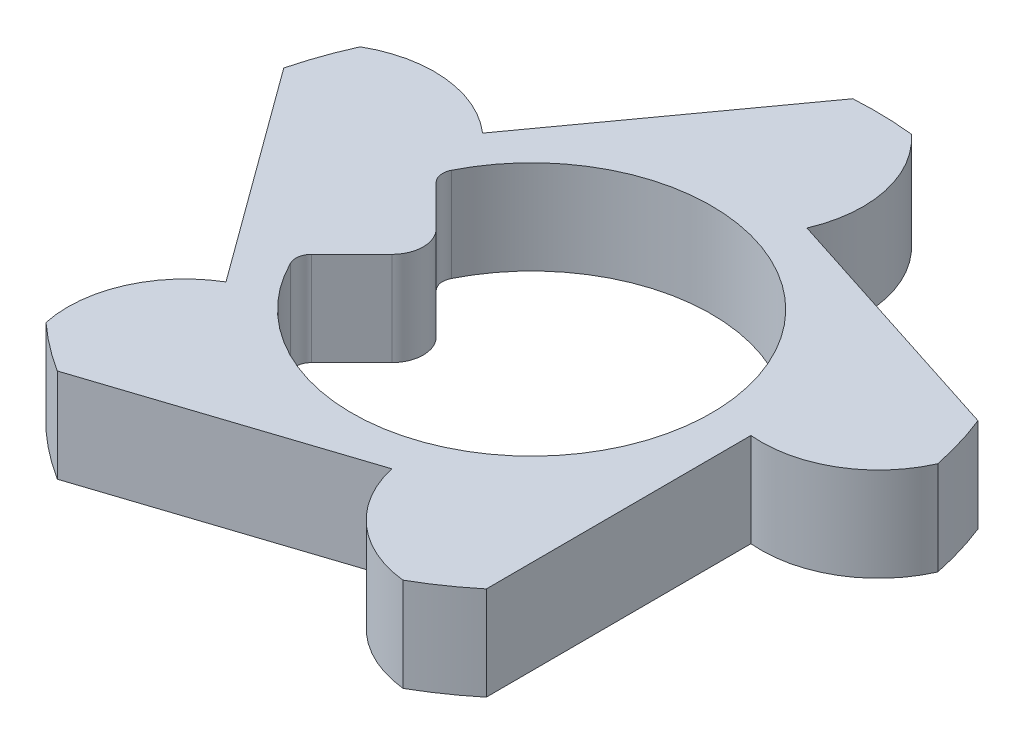
ISO-10303-21;
HEADER;
FILE_DESCRIPTION(('STEP AP214'),'2;1');
FILE_NAME('part.step','',(''),(''),'','','');
FILE_SCHEMA(('AUTOMOTIVE_DESIGN { 1 0 10303 214 1 1 1 1 }'));
ENDSEC;
DATA;
#1=APPLICATION_CONTEXT('core data for automotive mechanical design processes');
#2=APPLICATION_PROTOCOL_DEFINITION('international standard','automotive_design',2000,#1);
#3=PRODUCT_CONTEXT('',#1,'mechanical');
#4=PRODUCT('Part','Part','',(#3));
#5=PRODUCT_RELATED_PRODUCT_CATEGORY('part','',(#4));
#6=PRODUCT_DEFINITION_FORMATION('','',#4);
#7=PRODUCT_DEFINITION_CONTEXT('part definition',#1,'design');
#8=PRODUCT_DEFINITION('design','',#6,#7);
#9=PRODUCT_DEFINITION_SHAPE('','',#8);
#10=(LENGTH_UNIT() NAMED_UNIT(*) SI_UNIT(.MILLI.,.METRE.));
#11=(NAMED_UNIT(*) PLANE_ANGLE_UNIT() SI_UNIT($,.RADIAN.));
#12=(NAMED_UNIT(*) SI_UNIT($,.STERADIAN.) SOLID_ANGLE_UNIT());
#13=UNCERTAINTY_MEASURE_WITH_UNIT(LENGTH_MEASURE(1.E-05),#10,'distance_accuracy_value','');
#14=(GEOMETRIC_REPRESENTATION_CONTEXT(3) GLOBAL_UNCERTAINTY_ASSIGNED_CONTEXT((#13)) GLOBAL_UNIT_ASSIGNED_CONTEXT((#10,
#11,#12)) REPRESENTATION_CONTEXT('',''));
#15=CARTESIAN_POINT('',(0.,0.,0.));
#16=DIRECTION('',(0.,0.,1.));
#17=DIRECTION('',(1.,0.,0.));
#18=AXIS2_PLACEMENT_3D('',#15,#16,#17);
#19=CARTESIAN_POINT('',(0.,0.6,0.));
#20=DIRECTION('',(0.,-1.,0.));
#21=DIRECTION('',(0.,0.,-1.));
#22=AXIS2_PLACEMENT_3D('',#19,#20,#21);
#23=CYLINDRICAL_SURFACE('',#22,2.2);
#24=CARTESIAN_POINT('',(0.,0.,0.));
#25=DIRECTION('',(0.,1.,0.));
#26=DIRECTION('',(0.,0.,1.));
#27=AXIS2_PLACEMENT_3D('',#24,#25,#26);
#28=CIRCLE('',#27,2.2);
#29=CARTESIAN_POINT('',(0.243112339246083,0.,-2.18652610103477));
#30=VERTEX_POINT('',#29);
#31=CARTESIAN_POINT('',(-0.140209263389329,0.,-2.19552758180348));
#32=VERTEX_POINT('',#31);
#33=EDGE_CURVE('E212',#30,#32,#28,.T.);
#34=ORIENTED_EDGE('',*,*,#33,.T.);
#35=DIRECTION('',(0.,-1.,0.));
#36=VECTOR('',#35,1.);
#37=CARTESIAN_POINT('',(-0.140209263389329,0.6,-2.19552758180348));
#38=LINE('',#37,#36);
#39=CARTESIAN_POINT('',(-0.140209263389329,0.6,-2.19552758180348));
#40=VERTEX_POINT('',#39);
#41=EDGE_CURVE('E193',#40,#32,#38,.T.);
#42=ORIENTED_EDGE('',*,*,#41,.F.);
#43=CARTESIAN_POINT('',(0.,0.6,0.));
#44=DIRECTION('',(0.,1.,0.));
#45=DIRECTION('',(0.,0.,1.));
#46=AXIS2_PLACEMENT_3D('',#43,#44,#45);
#47=CIRCLE('',#46,2.2);
#48=CARTESIAN_POINT('',(0.243112339246083,0.6,-2.18652610103477));
#49=VERTEX_POINT('',#48);
#50=EDGE_CURVE('E200',#49,#40,#47,.T.);
#51=ORIENTED_EDGE('',*,*,#50,.F.);
#52=DIRECTION('',(0.,-1.,0.));
#53=VECTOR('',#52,1.);
#54=CARTESIAN_POINT('',(0.243112339246083,0.6,-2.18652610103477));
#55=LINE('',#54,#53);
#56=EDGE_CURVE('E284',#49,#30,#55,.T.);
#57=ORIENTED_EDGE('',*,*,#56,.T.);
#58=EDGE_LOOP('',(#34,#42,#51,#57));
#59=FACE_BOUND('',#58,.T.);
#60=ADVANCED_FACE('F47',(#59),#23,.T.);
#61=CARTESIAN_POINT('',(-1.13452842133559,0.6,-0.820271455788742));
#62=DIRECTION('',(0.810377443811132,0.,0.585908182706246));
#63=DIRECTION('',(0.585908182706246,0.,-0.810377443811132));
#64=AXIS2_PLACEMENT_3D('',#61,#62,#63);
#65=PLANE('',#64);
#66=DIRECTION('',(-0.585908182706246,0.,0.810377443811132));
#67=VECTOR('',#66,1.);
#68=CARTESIAN_POINT('',(-1.13452842133559,0.,-0.820271455788742));
#69=LINE('',#68,#67);
#70=CARTESIAN_POINT('',(-1.13452842133559,0.,-0.820271455788742));
#71=VERTEX_POINT('',#70);
#72=EDGE_CURVE('E286',#32,#71,#69,.T.);
#73=ORIENTED_EDGE('',*,*,#72,.T.);
#74=DIRECTION('',(0.,-1.,0.));
#75=VECTOR('',#74,1.);
#76=CARTESIAN_POINT('',(-1.13452842133559,0.6,-0.820271455788742));
#77=LINE('',#76,#75);
#78=CARTESIAN_POINT('',(-1.13452842133559,0.6,-0.820271455788742));
#79=VERTEX_POINT('',#78);
#80=EDGE_CURVE('E196',#79,#71,#77,.T.);
#81=ORIENTED_EDGE('',*,*,#80,.F.);
#82=DIRECTION('',(-0.585908182706246,0.,0.810377443811132));
#83=VECTOR('',#82,1.);
#84=CARTESIAN_POINT('',(-1.13452842133559,0.6,-0.820271455788742));
#85=LINE('',#84,#83);
#86=EDGE_CURVE('E189',#40,#79,#85,.T.);
#87=ORIENTED_EDGE('',*,*,#86,.F.);
#88=ORIENTED_EDGE('',*,*,#41,.T.);
#89=EDGE_LOOP('',(#73,#81,#87,#88));
#90=FACE_BOUND('',#89,.T.);
#91=ADVANCED_FACE('F191',(#90),#65,.F.);
#92=CARTESIAN_POINT('',(-1.62984623689458,0.6,-0.25710162208858));
#93=DIRECTION('',(0.,-1.,0.));
#94=DIRECTION('',(0.,0.,-1.));
#95=AXIS2_PLACEMENT_3D('',#92,#93,#94);
#96=CYLINDRICAL_SURFACE('',#95,0.75);
#97=CARTESIAN_POINT('',(-1.62984623689458,0.,-0.25710162208858));
#98=DIRECTION('',(0.,1.,0.));
#99=DIRECTION('',(0.,0.,1.));
#100=AXIS2_PLACEMENT_3D('',#97,#98,#99);
#101=CIRCLE('',#100,0.75);
#102=CARTESIAN_POINT('',(-2.00438405206926,0.,-0.906887298295876));
#103=VERTEX_POINT('',#102);
#104=EDGE_CURVE('E288',#71,#103,#101,.T.);
#105=ORIENTED_EDGE('',*,*,#104,.T.);
#106=DIRECTION('',(0.,-1.,0.));
#107=VECTOR('',#106,1.);
#108=CARTESIAN_POINT('',(-2.00438405206926,0.6,-0.906887298295876));
#109=LINE('',#108,#107);
#110=CARTESIAN_POINT('',(-2.00438405206926,0.6,-0.906887298295876));
#111=VERTEX_POINT('',#110);
#112=EDGE_CURVE('E218',#111,#103,#109,.T.);
#113=ORIENTED_EDGE('',*,*,#112,.F.);
#114=CARTESIAN_POINT('',(-1.62984623689458,0.6,-0.25710162208858));
#115=DIRECTION('',(0.,1.,0.));
#116=DIRECTION('',(0.,0.,1.));
#117=AXIS2_PLACEMENT_3D('',#114,#115,#116);
#118=CIRCLE('',#117,0.75);
#119=EDGE_CURVE('E199',#79,#111,#118,.T.);
#120=ORIENTED_EDGE('',*,*,#119,.F.);
#121=ORIENTED_EDGE('',*,*,#80,.T.);
#122=EDGE_LOOP('',(#105,#113,#120,#121));
#123=FACE_BOUND('',#122,.T.);
#124=ADVANCED_FACE('F370',(#123),#96,.T.);
#125=CARTESIAN_POINT('',(0.,0.6,0.));
#126=DIRECTION('',(0.,-1.,0.));
#127=DIRECTION('',(0.,0.,-1.));
#128=AXIS2_PLACEMENT_3D('',#125,#126,#127);
#129=CYLINDRICAL_SURFACE('',#128,2.2);
#130=CARTESIAN_POINT('',(0.,0.,0.));
#131=DIRECTION('',(0.,1.,0.));
#132=DIRECTION('',(0.,0.,1.));
#133=AXIS2_PLACEMENT_3D('',#130,#131,#132);
#134=CIRCLE('',#133,2.2);
#135=CARTESIAN_POINT('',(-2.13139785853603,0.,-0.545108400804861));
#136=VERTEX_POINT('',#135);
#137=EDGE_CURVE('E290',#103,#136,#134,.T.);
#138=ORIENTED_EDGE('',*,*,#137,.T.);
#139=DIRECTION('',(0.,-1.,0.));
#140=VECTOR('',#139,1.);
#141=CARTESIAN_POINT('',(-2.13139785853603,0.6,-0.545108400804861));
#142=LINE('',#141,#140);
#143=CARTESIAN_POINT('',(-2.13139785853603,0.6,-0.545108400804861));
#144=VERTEX_POINT('',#143);
#145=EDGE_CURVE('E344',#144,#136,#142,.T.);
#146=ORIENTED_EDGE('',*,*,#145,.F.);
#147=CARTESIAN_POINT('',(0.,0.6,0.));
#148=DIRECTION('',(0.,1.,0.));
#149=DIRECTION('',(0.,0.,1.));
#150=AXIS2_PLACEMENT_3D('',#147,#148,#149);
#151=CIRCLE('',#150,2.2);
#152=EDGE_CURVE('E261',#111,#144,#151,.T.);
#153=ORIENTED_EDGE('',*,*,#152,.F.);
#154=ORIENTED_EDGE('',*,*,#112,.T.);
#155=EDGE_LOOP('',(#138,#146,#153,#154));
#156=FACE_BOUND('',#155,.T.);
#157=ADVANCED_FACE('F351',(#156),#129,.T.);
#158=CARTESIAN_POINT('',(-1.13071307595288,0.6,0.825522828193851));
#159=DIRECTION('',(0.807652197109201,0.,-0.589659162995608));
#160=DIRECTION('',(-0.589659162995608,0.,-0.807652197109201));
#161=AXIS2_PLACEMENT_3D('',#158,#159,#160);
#162=PLANE('',#161);
#163=DIRECTION('',(0.589659162995608,0.,0.8076521971092));
#164=VECTOR('',#163,1.);
#165=CARTESIAN_POINT('',(-1.13071307595288,0.,0.825522828193851));
#166=LINE('',#165,#164);
#167=CARTESIAN_POINT('',(-1.13071307595288,0.,0.825522828193851));
#168=VERTEX_POINT('',#167);
#169=EDGE_CURVE('E292',#136,#168,#166,.T.);
#170=ORIENTED_EDGE('',*,*,#169,.T.);
#171=DIRECTION('',(0.,-1.,0.));
#172=VECTOR('',#171,1.);
#173=CARTESIAN_POINT('',(-1.13071307595288,0.6,0.825522828193851));
#174=LINE('',#173,#172);
#175=CARTESIAN_POINT('',(-1.13071307595288,0.6,0.825522828193851));
#176=VERTEX_POINT('',#175);
#177=EDGE_CURVE('E341',#176,#168,#174,.T.);
#178=ORIENTED_EDGE('',*,*,#177,.F.);
#179=DIRECTION('',(0.589659162995608,0.,0.8076521971092));
#180=VECTOR('',#179,1.);
#181=CARTESIAN_POINT('',(-1.13071307595288,0.6,0.825522828193851));
#182=LINE('',#181,#180);
#183=EDGE_CURVE('E263',#144,#176,#182,.T.);
#184=ORIENTED_EDGE('',*,*,#183,.F.);
#185=ORIENTED_EDGE('',*,*,#145,.T.);
#186=EDGE_LOOP('',(#170,#178,#184,#185));
#187=FACE_BOUND('',#186,.T.);
#188=ADVANCED_FACE('F362',(#187),#162,.F.);
#189=CARTESIAN_POINT('',(-0.748168358455879,0.6,1.47062711365099));
#190=DIRECTION('',(0.,-1.,0.));
#191=DIRECTION('',(0.,0.,-1.));
#192=AXIS2_PLACEMENT_3D('',#189,#190,#191);
#193=CYLINDRICAL_SURFACE('',#192,0.750000000000016);
#194=CARTESIAN_POINT('',(-0.748168358455879,0.,1.47062711365099));
#195=DIRECTION('',(0.,1.,0.));
#196=DIRECTION('',(0.,0.,1.));
#197=AXIS2_PLACEMENT_3D('',#194,#195,#196);
#198=CIRCLE('',#197,0.750000000000016);
#199=CARTESIAN_POINT('',(-1.48188980993314,0.,1.62603892672233));
#200=VERTEX_POINT('',#199);
#201=EDGE_CURVE('E294',#168,#200,#198,.T.);
#202=ORIENTED_EDGE('',*,*,#201,.T.);
#203=DIRECTION('',(0.,-1.,0.));
#204=VECTOR('',#203,1.);
#205=CARTESIAN_POINT('',(-1.48188980993314,0.6,1.62603892672233));
#206=LINE('',#205,#204);
#207=CARTESIAN_POINT('',(-1.48188980993314,0.6,1.62603892672233));
#208=VERTEX_POINT('',#207);
#209=EDGE_CURVE('E338',#208,#200,#206,.T.);
#210=ORIENTED_EDGE('',*,*,#209,.F.);
#211=CARTESIAN_POINT('',(-0.748168358455879,0.6,1.47062711365099));
#212=DIRECTION('',(0.,1.,0.));
#213=DIRECTION('',(0.,0.,1.));
#214=AXIS2_PLACEMENT_3D('',#211,#212,#213);
#215=CIRCLE('',#214,0.750000000000016);
#216=EDGE_CURVE('E265',#176,#208,#215,.T.);
#217=ORIENTED_EDGE('',*,*,#216,.F.);
#218=ORIENTED_EDGE('',*,*,#177,.T.);
#219=EDGE_LOOP('',(#202,#210,#217,#218));
#220=FACE_BOUND('',#219,.T.);
#221=ADVANCED_FACE('F366',(#220),#193,.T.);
#222=CARTESIAN_POINT('',(0.,0.6,0.));
#223=DIRECTION('',(0.,-1.,0.));
#224=DIRECTION('',(0.,0.,-1.));
#225=AXIS2_PLACEMENT_3D('',#222,#223,#224);
#226=CYLINDRICAL_SURFACE('',#225,2.2);
#227=CARTESIAN_POINT('',(0.,0.,0.));
#228=DIRECTION('',(0.,1.,0.));
#229=DIRECTION('',(0.,0.,1.));
#230=AXIS2_PLACEMENT_3D('',#227,#228,#229);
#231=CIRCLE('',#230,2.2);
#232=CARTESIAN_POINT('',(-1.17706705673467,0.,1.85863206255299));
#233=VERTEX_POINT('',#232);
#234=EDGE_CURVE('E296',#200,#233,#231,.T.);
#235=ORIENTED_EDGE('',*,*,#234,.T.);
#236=DIRECTION('',(0.,-1.,0.));
#237=VECTOR('',#236,1.);
#238=CARTESIAN_POINT('',(-1.17706705673467,0.6,1.85863206255299));
#239=LINE('',#238,#237);
#240=CARTESIAN_POINT('',(-1.17706705673467,0.6,1.85863206255299));
#241=VERTEX_POINT('',#240);
#242=EDGE_CURVE('E335',#241,#233,#239,.T.);
#243=ORIENTED_EDGE('',*,*,#242,.F.);
#244=CARTESIAN_POINT('',(0.,0.6,0.));
#245=DIRECTION('',(0.,1.,0.));
#246=DIRECTION('',(0.,0.,1.));
#247=AXIS2_PLACEMENT_3D('',#244,#245,#246);
#248=CIRCLE('',#247,2.2);
#249=EDGE_CURVE('E267',#208,#241,#248,.T.);
#250=ORIENTED_EDGE('',*,*,#249,.F.);
#251=ORIENTED_EDGE('',*,*,#209,.T.);
#252=EDGE_LOOP('',(#235,#243,#250,#251));
#253=FACE_BOUND('',#252,.T.);
#254=ADVANCED_FACE('F452',(#253),#226,.T.);
#255=CARTESIAN_POINT('',(0.435709308872771,0.6,1.33047262210149));
#256=DIRECTION('',(-0.311220934909123,0.,-0.950337587215349));
#257=DIRECTION('',(-0.950337587215349,0.,0.311220934909123));
#258=AXIS2_PLACEMENT_3D('',#255,#256,#257);
#259=PLANE('',#258);
#260=DIRECTION('',(0.950337587215349,0.,-0.311220934909123));
#261=VECTOR('',#260,1.);
#262=CARTESIAN_POINT('',(0.435709308872771,0.,1.33047262210149));
#263=LINE('',#262,#261);
#264=CARTESIAN_POINT('',(0.435709308872771,0.,1.33047262210149));
#265=VERTEX_POINT('',#264);
#266=EDGE_CURVE('E298',#233,#265,#263,.T.);
#267=ORIENTED_EDGE('',*,*,#266,.T.);
#268=DIRECTION('',(0.,-1.,0.));
#269=VECTOR('',#268,1.);
#270=CARTESIAN_POINT('',(0.435709308872771,0.6,1.33047262210149));
#271=LINE('',#270,#269);
#272=CARTESIAN_POINT('',(0.435709308872771,0.6,1.33047262210149));
#273=VERTEX_POINT('',#272);
#274=EDGE_CURVE('E332',#273,#265,#271,.T.);
#275=ORIENTED_EDGE('',*,*,#274,.F.);
#276=DIRECTION('',(0.950337587215349,0.,-0.311220934909123));
#277=VECTOR('',#276,1.);
#278=CARTESIAN_POINT('',(0.435709308872771,0.6,1.33047262210149));
#279=LINE('',#278,#277);
#280=EDGE_CURVE('E269',#241,#273,#279,.T.);
#281=ORIENTED_EDGE('',*,*,#280,.F.);
#282=ORIENTED_EDGE('',*,*,#242,.T.);
#283=EDGE_LOOP('',(#267,#275,#281,#282));
#284=FACE_BOUND('',#283,.T.);
#285=ADVANCED_FACE('F448',(#284),#259,.F.);
#286=CARTESIAN_POINT('',(1.16745276206162,0.6,1.16599916310206));
#287=DIRECTION('',(0.,-1.,0.));
#288=DIRECTION('',(0.,0.,-1.));
#289=AXIS2_PLACEMENT_3D('',#286,#287,#288);
#290=CYLINDRICAL_SURFACE('',#289,0.749999999999994);
#291=CARTESIAN_POINT('',(1.16745276206162,0.,1.16599916310206));
#292=DIRECTION('',(0.,1.,0.));
#293=DIRECTION('',(0.,0.,1.));
#294=AXIS2_PLACEMENT_3D('',#291,#292,#293);
#295=CIRCLE('',#294,0.749999999999994);
#296=CARTESIAN_POINT('',(1.08852578194846,0.,1.91183462204069));
#297=VERTEX_POINT('',#296);
#298=EDGE_CURVE('E300',#265,#297,#295,.T.);
#299=ORIENTED_EDGE('',*,*,#298,.T.);
#300=DIRECTION('',(0.,-1.,0.));
#301=VECTOR('',#300,1.);
#302=CARTESIAN_POINT('',(1.08852578194846,0.6,1.91183462204069));
#303=LINE('',#302,#301);
#304=CARTESIAN_POINT('',(1.08852578194846,0.6,1.91183462204069));
#305=VERTEX_POINT('',#304);
#306=EDGE_CURVE('E329',#305,#297,#303,.T.);
#307=ORIENTED_EDGE('',*,*,#306,.F.);
#308=CARTESIAN_POINT('',(1.16745276206162,0.6,1.16599916310206));
#309=DIRECTION('',(0.,1.,0.));
#310=DIRECTION('',(0.,0.,1.));
#311=AXIS2_PLACEMENT_3D('',#308,#309,#310);
#312=CIRCLE('',#311,0.749999999999994);
#313=EDGE_CURVE('E271',#273,#305,#312,.T.);
#314=ORIENTED_EDGE('',*,*,#313,.F.);
#315=ORIENTED_EDGE('',*,*,#274,.T.);
#316=EDGE_LOOP('',(#299,#307,#314,#315));
#317=FACE_BOUND('',#316,.T.);
#318=ADVANCED_FACE('F444',(#317),#290,.T.);
#319=CARTESIAN_POINT('',(0.,0.6,0.));
#320=DIRECTION('',(0.,-1.,0.));
#321=DIRECTION('',(0.,0.,-1.));
#322=AXIS2_PLACEMENT_3D('',#319,#320,#321);
#323=CYLINDRICAL_SURFACE('',#322,2.2);
#324=CARTESIAN_POINT('',(0.,0.,0.));
#325=DIRECTION('',(0.,1.,0.));
#326=DIRECTION('',(0.,0.,1.));
#327=AXIS2_PLACEMENT_3D('',#324,#325,#326);
#328=CIRCLE('',#327,2.2);
#329=CARTESIAN_POINT('',(1.40393041043621,0.,1.6938061880429));
#330=VERTEX_POINT('',#329);
#331=EDGE_CURVE('E302',#297,#330,#328,.T.);
#332=ORIENTED_EDGE('',*,*,#331,.T.);
#333=DIRECTION('',(0.,-1.,0.));
#334=VECTOR('',#333,1.);
#335=CARTESIAN_POINT('',(1.40393041043621,0.6,1.6938061880429));
#336=LINE('',#335,#334);
#337=CARTESIAN_POINT('',(1.40393041043621,0.6,1.6938061880429));
#338=VERTEX_POINT('',#337);
#339=EDGE_CURVE('E326',#338,#330,#336,.T.);
#340=ORIENTED_EDGE('',*,*,#339,.F.);
#341=CARTESIAN_POINT('',(0.,0.6,0.));
#342=DIRECTION('',(0.,1.,0.));
#343=DIRECTION('',(0.,0.,1.));
#344=AXIS2_PLACEMENT_3D('',#341,#342,#343);
#345=CIRCLE('',#344,2.2);
#346=EDGE_CURVE('E273',#305,#338,#345,.T.);
#347=ORIENTED_EDGE('',*,*,#346,.F.);
#348=ORIENTED_EDGE('',*,*,#306,.T.);
#349=EDGE_LOOP('',(#332,#340,#347,#348));
#350=FACE_BOUND('',#349,.T.);
#351=ADVANCED_FACE('F440',(#350),#323,.T.);
#352=CARTESIAN_POINT('',(1.39999623805097,0.6,-0.00324552663394069));
#353=DIRECTION('',(-0.99999731289355,0.,0.00231823330996412));
#354=DIRECTION('',(0.00231823330996412,0.,0.99999731289355));
#355=AXIS2_PLACEMENT_3D('',#352,#353,#354);
#356=PLANE('',#355);
#357=DIRECTION('',(-0.00231823330996412,0.,-0.99999731289355));
#358=VECTOR('',#357,1.);
#359=CARTESIAN_POINT('',(1.39999623805097,0.,-0.00324552663394069));
#360=LINE('',#359,#358);
#361=CARTESIAN_POINT('',(1.39999623805097,0.,-0.00324552663394069));
#362=VERTEX_POINT('',#361);
#363=EDGE_CURVE('E304',#330,#362,#360,.T.);
#364=ORIENTED_EDGE('',*,*,#363,.T.);
#365=DIRECTION('',(0.,-1.,0.));
#366=VECTOR('',#365,1.);
#367=CARTESIAN_POINT('',(1.39999623805097,0.6,-0.00324552663394069));
#368=LINE('',#367,#366);
#369=CARTESIAN_POINT('',(1.39999623805097,0.6,-0.00324552663394069));
#370=VERTEX_POINT('',#369);
#371=EDGE_CURVE('E323',#370,#362,#368,.T.);
#372=ORIENTED_EDGE('',*,*,#371,.F.);
#373=DIRECTION('',(-0.00231823330996412,0.,-0.99999731289355));
#374=VECTOR('',#373,1.);
#375=CARTESIAN_POINT('',(1.39999623805097,0.6,-0.00324552663394069));
#376=LINE('',#375,#374);
#377=EDGE_CURVE('E275',#338,#370,#376,.T.);
#378=ORIENTED_EDGE('',*,*,#377,.F.);
#379=ORIENTED_EDGE('',*,*,#339,.T.);
#380=EDGE_LOOP('',(#364,#372,#378,#379));
#381=FACE_BOUND('',#380,.T.);
#382=ADVANCED_FACE('F436',(#381),#356,.F.);
#383=CARTESIAN_POINT('',(1.46969384566992,0.6,-0.749999999999983));
#384=DIRECTION('',(0.,-1.,0.));
#385=DIRECTION('',(0.,0.,-1.));
#386=AXIS2_PLACEMENT_3D('',#383,#384,#385);
#387=CYLINDRICAL_SURFACE('',#386,0.75);
#388=CARTESIAN_POINT('',(1.46969384566992,0.,-0.749999999999983));
#389=DIRECTION('',(0.,1.,0.));
#390=DIRECTION('',(0.,0.,1.));
#391=AXIS2_PLACEMENT_3D('',#388,#389,#390);
#392=CIRCLE('',#391,0.75);
#393=CARTESIAN_POINT('',(2.15463574080784,0.,-0.444460149432384));
#394=VERTEX_POINT('',#393);
#395=EDGE_CURVE('E306',#362,#394,#392,.T.);
#396=ORIENTED_EDGE('',*,*,#395,.T.);
#397=DIRECTION('',(0.,-1.,0.));
#398=VECTOR('',#397,1.);
#399=CARTESIAN_POINT('',(2.15463574080784,0.6,-0.444460149432384));
#400=LINE('',#399,#398);
#401=CARTESIAN_POINT('',(2.15463574080784,0.6,-0.444460149432384));
#402=VERTEX_POINT('',#401);
#403=EDGE_CURVE('E320',#402,#394,#400,.T.);
#404=ORIENTED_EDGE('',*,*,#403,.F.);
#405=CARTESIAN_POINT('',(1.46969384566992,0.6,-0.749999999999983));
#406=DIRECTION('',(0.,1.,0.));
#407=DIRECTION('',(0.,0.,1.));
#408=AXIS2_PLACEMENT_3D('',#405,#406,#407);
#409=CIRCLE('',#408,0.75);
#410=EDGE_CURVE('E277',#370,#402,#409,.T.);
#411=ORIENTED_EDGE('',*,*,#410,.F.);
#412=ORIENTED_EDGE('',*,*,#371,.T.);
#413=EDGE_LOOP('',(#396,#404,#411,#412));
#414=FACE_BOUND('',#413,.T.);
#415=ADVANCED_FACE('F432',(#414),#387,.T.);
#416=CARTESIAN_POINT('',(0.,0.6,0.));
#417=DIRECTION('',(0.,-1.,0.));
#418=DIRECTION('',(0.,0.,-1.));
#419=AXIS2_PLACEMENT_3D('',#416,#417,#418);
#420=CYLINDRICAL_SURFACE('',#419,2.2);
#421=CARTESIAN_POINT('',(0.,0.,0.));
#422=DIRECTION('',(0.,1.,0.));
#423=DIRECTION('',(0.,0.,1.));
#424=AXIS2_PLACEMENT_3D('',#421,#422,#423);
#425=CIRCLE('',#424,2.2);
#426=CARTESIAN_POINT('',(2.04474376822384,0.,-0.811802267987579));
#427=VERTEX_POINT('',#426);
#428=EDGE_CURVE('E308',#394,#427,#425,.T.);
#429=ORIENTED_EDGE('',*,*,#428,.T.);
#430=DIRECTION('',(0.,-1.,0.));
#431=VECTOR('',#430,1.);
#432=CARTESIAN_POINT('',(2.04474376822384,0.6,-0.811802267987579));
#433=LINE('',#432,#431);
#434=CARTESIAN_POINT('',(2.04474376822384,0.6,-0.811802267987579));
#435=VERTEX_POINT('',#434);
#436=EDGE_CURVE('E317',#435,#427,#433,.T.);
#437=ORIENTED_EDGE('',*,*,#436,.F.);
#438=CARTESIAN_POINT('',(0.,0.6,0.));
#439=DIRECTION('',(0.,1.,0.));
#440=DIRECTION('',(0.,0.,1.));
#441=AXIS2_PLACEMENT_3D('',#438,#439,#440);
#442=CIRCLE('',#441,2.2);
#443=EDGE_CURVE('E279',#402,#435,#442,.T.);
#444=ORIENTED_EDGE('',*,*,#443,.F.);
#445=ORIENTED_EDGE('',*,*,#403,.T.);
#446=EDGE_LOOP('',(#429,#437,#444,#445));
#447=FACE_BOUND('',#446,.T.);
#448=ADVANCED_FACE('F428',(#447),#420,.T.);
#449=CARTESIAN_POINT('',(0.429535950364721,0.6,-1.33247846787266));
#450=DIRECTION('',(-0.306811393117655,0.,0.951770334194759));
#451=DIRECTION('',(0.951770334194759,0.,0.306811393117655));
#452=AXIS2_PLACEMENT_3D('',#449,#450,#451);
#453=PLANE('',#452);
#454=DIRECTION('',(-0.951770334194759,0.,-0.306811393117655));
#455=VECTOR('',#454,1.);
#456=CARTESIAN_POINT('',(0.429535950364721,0.,-1.33247846787266));
#457=LINE('',#456,#455);
#458=CARTESIAN_POINT('',(0.429535950364721,0.,-1.33247846787266));
#459=VERTEX_POINT('',#458);
#460=EDGE_CURVE('E310',#427,#459,#457,.T.);
#461=ORIENTED_EDGE('',*,*,#460,.T.);
#462=DIRECTION('',(0.,-1.,0.));
#463=VECTOR('',#462,1.);
#464=CARTESIAN_POINT('',(0.429535950364721,0.6,-1.33247846787266));
#465=LINE('',#464,#463);
#466=CARTESIAN_POINT('',(0.429535950364721,0.6,-1.33247846787266));
#467=VERTEX_POINT('',#466);
#468=EDGE_CURVE('E314',#467,#459,#465,.T.);
#469=ORIENTED_EDGE('',*,*,#468,.F.);
#470=DIRECTION('',(-0.951770334194759,0.,-0.306811393117655));
#471=VECTOR('',#470,1.);
#472=CARTESIAN_POINT('',(0.429535950364721,0.6,-1.33247846787266));
#473=LINE('',#472,#471);
#474=EDGE_CURVE('E281',#435,#467,#473,.T.);
#475=ORIENTED_EDGE('',*,*,#474,.F.);
#476=ORIENTED_EDGE('',*,*,#436,.T.);
#477=EDGE_LOOP('',(#461,#469,#475,#476));
#478=FACE_BOUND('',#477,.T.);
#479=ADVANCED_FACE('F424',(#478),#453,.F.);
#480=CARTESIAN_POINT('',(-0.259132012381083,0.6,-1.62952465466446));
#481=DIRECTION('',(0.,-1.,0.));
#482=DIRECTION('',(0.,0.,-1.));
#483=AXIS2_PLACEMENT_3D('',#480,#481,#482);
#484=CYLINDRICAL_SURFACE('',#483,0.750000000000004);
#485=CARTESIAN_POINT('',(-0.259132012381083,0.,-1.62952465466446));
#486=DIRECTION('',(0.,1.,0.));
#487=DIRECTION('',(0.,0.,1.));
#488=AXIS2_PLACEMENT_3D('',#485,#486,#487);
#489=CIRCLE('',#488,0.750000000000004);
#490=EDGE_CURVE('E209',#459,#30,#489,.T.);
#491=ORIENTED_EDGE('',*,*,#490,.T.);
#492=ORIENTED_EDGE('',*,*,#56,.F.);
#493=CARTESIAN_POINT('',(-0.259132012381083,0.6,-1.62952465466446));
#494=DIRECTION('',(0.,1.,0.));
#495=DIRECTION('',(0.,0.,1.));
#496=AXIS2_PLACEMENT_3D('',#493,#494,#495);
#497=CIRCLE('',#496,0.750000000000004);
#498=EDGE_CURVE('E205',#467,#49,#497,.T.);
#499=ORIENTED_EDGE('',*,*,#498,.F.);
#500=ORIENTED_EDGE('',*,*,#468,.T.);
#501=EDGE_LOOP('',(#491,#492,#499,#500));
#502=FACE_BOUND('',#501,.T.);
#503=ADVANCED_FACE('F419',(#502),#484,.T.);
#504=CARTESIAN_POINT('',(0.,0.6,0.));
#505=DIRECTION('',(0.,1.,0.));
#506=DIRECTION('',(0.,0.,1.));
#507=AXIS2_PLACEMENT_3D('',#504,#505,#506);
#508=PLANE('',#507);
#509=DIRECTION('',(-0.707106781186548,0.,0.707106781186547));
#510=VECTOR('',#509,1.);
#511=CARTESIAN_POINT('',(-0.611,0.6,0.));
#512=LINE('',#511,#510);
#513=CARTESIAN_POINT('',(-0.75242135623731,0.6,0.14142135623731));
#514=VERTEX_POINT('',#513);
#515=CARTESIAN_POINT('',(-1.00986068482738,0.6,0.398860684827381));
#516=VERTEX_POINT('',#515);
#517=EDGE_CURVE('E245',#514,#516,#512,.T.);
#518=ORIENTED_EDGE('',*,*,#517,.F.);
#519=CARTESIAN_POINT('',(-0.893842712474619,0.6,0.));
#520=DIRECTION('',(0.,1.,0.));
#521=DIRECTION('',(0.,0.,1.));
#522=AXIS2_PLACEMENT_3D('',#519,#520,#521);
#523=CIRCLE('',#522,0.2);
#524=CARTESIAN_POINT('',(-0.75242135623731,0.6,-0.141421356237309));
#525=VERTEX_POINT('',#524);
#526=EDGE_CURVE('E69',#514,#525,#523,.T.);
#527=ORIENTED_EDGE('',*,*,#526,.T.);
#528=DIRECTION('',(0.707106781186548,0.,0.707106781186547));
#529=VECTOR('',#528,1.);
#530=CARTESIAN_POINT('',(-1.059104505029,0.6,-0.448104505028997));
#531=LINE('',#530,#529);
#532=CARTESIAN_POINT('',(-1.00986068482738,0.6,-0.398860684827381));
#533=VERTEX_POINT('',#532);
#534=EDGE_CURVE('E253',#533,#525,#531,.T.);
#535=ORIENTED_EDGE('',*,*,#534,.F.);
#536=CARTESIAN_POINT('',(-0.939150006708727,0.6,-0.469571362946036));
#537=DIRECTION('',(0.,1.,0.));
#538=DIRECTION('',(0.,0.,1.));
#539=AXIS2_PLACEMENT_3D('',#536,#537,#538);
#540=CIRCLE('',#539,0.1);
#541=CARTESIAN_POINT('',(-1.02859286449051,0.6,-0.514292445131373));
#542=VERTEX_POINT('',#541);
#543=EDGE_CURVE('E228',#533,#542,#540,.F.);
#544=ORIENTED_EDGE('',*,*,#543,.T.);
#545=CARTESIAN_POINT('',(0.,0.6,0.));
#546=DIRECTION('',(0.,1.,0.));
#547=DIRECTION('',(0.,0.,1.));
#548=AXIS2_PLACEMENT_3D('',#545,#546,#547);
#549=CIRCLE('',#548,1.15);
#550=CARTESIAN_POINT('',(-1.02859286449051,0.6,0.514292445131373));
#551=VERTEX_POINT('',#550);
#552=EDGE_CURVE('E256',#551,#542,#549,.T.);
#553=ORIENTED_EDGE('',*,*,#552,.F.);
#554=CARTESIAN_POINT('',(-0.939150006708727,0.6,0.469571362946036));
#555=DIRECTION('',(0.,1.,0.));
#556=DIRECTION('',(0.,0.,1.));
#557=AXIS2_PLACEMENT_3D('',#554,#555,#556);
#558=CIRCLE('',#557,0.1);
#559=EDGE_CURVE('E233',#551,#516,#558,.F.);
#560=ORIENTED_EDGE('',*,*,#559,.T.);
#561=EDGE_LOOP('',(#518,#527,#535,#544,#553,#560));
#562=FACE_BOUND('',#561,.T.);
#563=ORIENTED_EDGE('',*,*,#50,.T.);
#564=ORIENTED_EDGE('',*,*,#86,.T.);
#565=ORIENTED_EDGE('',*,*,#119,.T.);
#566=ORIENTED_EDGE('',*,*,#152,.T.);
#567=ORIENTED_EDGE('',*,*,#183,.T.);
#568=ORIENTED_EDGE('',*,*,#216,.T.);
#569=ORIENTED_EDGE('',*,*,#249,.T.);
#570=ORIENTED_EDGE('',*,*,#280,.T.);
#571=ORIENTED_EDGE('',*,*,#313,.T.);
#572=ORIENTED_EDGE('',*,*,#346,.T.);
#573=ORIENTED_EDGE('',*,*,#377,.T.);
#574=ORIENTED_EDGE('',*,*,#410,.T.);
#575=ORIENTED_EDGE('',*,*,#443,.T.);
#576=ORIENTED_EDGE('',*,*,#474,.T.);
#577=ORIENTED_EDGE('',*,*,#498,.T.);
#578=EDGE_LOOP('',(#563,#564,#565,#566,#567,#568,#569,#570,#571,#572,#573,#574,#575,#576,#577));
#579=FACE_BOUND('',#578,.T.);
#580=ADVANCED_FACE('F203',(#562,#579),#508,.T.);
#581=CARTESIAN_POINT('',(0.,0.,0.));
#582=DIRECTION('',(0.,1.,0.));
#583=DIRECTION('',(0.,0.,1.));
#584=AXIS2_PLACEMENT_3D('',#581,#582,#583);
#585=PLANE('',#584);
#586=DIRECTION('',(-0.707106781186548,0.,-0.707106781186547));
#587=VECTOR('',#586,1.);
#588=CARTESIAN_POINT('',(-1.059104505029,0.,-0.448104505028997));
#589=LINE('',#588,#587);
#590=CARTESIAN_POINT('',(-0.752421356237309,0.,-0.141421356237309));
#591=VERTEX_POINT('',#590);
#592=CARTESIAN_POINT('',(-1.00986068482738,0.,-0.398860684827381));
#593=VERTEX_POINT('',#592);
#594=EDGE_CURVE('E252',#591,#593,#589,.T.);
#595=ORIENTED_EDGE('',*,*,#594,.F.);
#596=CARTESIAN_POINT('',(-0.893842712474619,0.,0.));
#597=DIRECTION('',(0.,1.,0.));
#598=DIRECTION('',(0.,0.,1.));
#599=AXIS2_PLACEMENT_3D('',#596,#597,#598);
#600=CIRCLE('',#599,0.2);
#601=CARTESIAN_POINT('',(-0.75242135623731,0.,0.14142135623731));
#602=VERTEX_POINT('',#601);
#603=EDGE_CURVE('E13',#591,#602,#600,.F.);
#604=ORIENTED_EDGE('',*,*,#603,.T.);
#605=DIRECTION('',(0.707106781186548,0.,-0.707106781186547));
#606=VECTOR('',#605,1.);
#607=CARTESIAN_POINT('',(-0.611,0.,0.));
#608=LINE('',#607,#606);
#609=CARTESIAN_POINT('',(-1.00986068482738,0.,0.398860684827381));
#610=VERTEX_POINT('',#609);
#611=EDGE_CURVE('E247',#610,#602,#608,.T.);
#612=ORIENTED_EDGE('',*,*,#611,.F.);
#613=CARTESIAN_POINT('',(-0.939150006708727,0.,0.469571362946036));
#614=DIRECTION('',(0.,1.,0.));
#615=DIRECTION('',(0.,0.,1.));
#616=AXIS2_PLACEMENT_3D('',#613,#614,#615);
#617=CIRCLE('',#616,0.1);
#618=CARTESIAN_POINT('',(-1.02859286449051,0.,0.514292445131373));
#619=VERTEX_POINT('',#618);
#620=EDGE_CURVE('E236',#610,#619,#617,.T.);
#621=ORIENTED_EDGE('',*,*,#620,.T.);
#622=CARTESIAN_POINT('',(0.,0.,0.));
#623=DIRECTION('',(0.,1.,0.));
#624=DIRECTION('',(0.,0.,1.));
#625=AXIS2_PLACEMENT_3D('',#622,#623,#624);
#626=CIRCLE('',#625,1.15);
#627=CARTESIAN_POINT('',(-1.02859286449051,0.,-0.514292445131373));
#628=VERTEX_POINT('',#627);
#629=EDGE_CURVE('E399',#628,#619,#626,.F.);
#630=ORIENTED_EDGE('',*,*,#629,.F.);
#631=CARTESIAN_POINT('',(-0.939150006708727,0.,-0.469571362946036));
#632=DIRECTION('',(0.,1.,0.));
#633=DIRECTION('',(0.,0.,1.));
#634=AXIS2_PLACEMENT_3D('',#631,#632,#633);
#635=CIRCLE('',#634,0.1);
#636=EDGE_CURVE('E230',#628,#593,#635,.T.);
#637=ORIENTED_EDGE('',*,*,#636,.T.);
#638=EDGE_LOOP('',(#595,#604,#612,#621,#630,#637));
#639=FACE_BOUND('',#638,.T.);
#640=ORIENTED_EDGE('',*,*,#33,.F.);
#641=ORIENTED_EDGE('',*,*,#490,.F.);
#642=ORIENTED_EDGE('',*,*,#460,.F.);
#643=ORIENTED_EDGE('',*,*,#428,.F.);
#644=ORIENTED_EDGE('',*,*,#395,.F.);
#645=ORIENTED_EDGE('',*,*,#363,.F.);
#646=ORIENTED_EDGE('',*,*,#331,.F.);
#647=ORIENTED_EDGE('',*,*,#298,.F.);
#648=ORIENTED_EDGE('',*,*,#266,.F.);
#649=ORIENTED_EDGE('',*,*,#234,.F.);
#650=ORIENTED_EDGE('',*,*,#201,.F.);
#651=ORIENTED_EDGE('',*,*,#169,.F.);
#652=ORIENTED_EDGE('',*,*,#137,.F.);
#653=ORIENTED_EDGE('',*,*,#104,.F.);
#654=ORIENTED_EDGE('',*,*,#72,.F.);
#655=EDGE_LOOP('',(#640,#641,#642,#643,#644,#645,#646,#647,#648,#649,#650,#651,#652,#653,#654));
#656=FACE_BOUND('',#655,.T.);
#657=ADVANCED_FACE('F357',(#639,#656),#585,.F.);
#658=CARTESIAN_POINT('',(0.,-0.00100000000000002,0.));
#659=DIRECTION('',(0.,1.,0.));
#660=DIRECTION('',(0.,0.,1.));
#661=AXIS2_PLACEMENT_3D('',#658,#659,#660);
#662=CYLINDRICAL_SURFACE('',#661,1.15);
#663=ORIENTED_EDGE('',*,*,#552,.T.);
#664=DIRECTION('',(0.,1.,0.));
#665=VECTOR('',#664,1.);
#666=CARTESIAN_POINT('',(-1.02859286449051,-0.00100000000000002,-0.514292445131373));
#667=LINE('',#666,#665);
#668=EDGE_CURVE('E224',#542,#628,#667,.F.);
#669=ORIENTED_EDGE('',*,*,#668,.T.);
#670=ORIENTED_EDGE('',*,*,#629,.T.);
#671=DIRECTION('',(0.,1.,0.));
#672=VECTOR('',#671,1.);
#673=CARTESIAN_POINT('',(-1.02859286449051,-0.00100000000000002,0.514292445131373));
#674=LINE('',#673,#672);
#675=EDGE_CURVE('E216',#619,#551,#674,.T.);
#676=ORIENTED_EDGE('',*,*,#675,.T.);
#677=EDGE_LOOP('',(#663,#669,#670,#676));
#678=FACE_BOUND('',#677,.T.);
#679=ADVANCED_FACE('F403',(#678),#662,.F.);
#680=CARTESIAN_POINT('',(-0.611,-0.00100000000000002,0.));
#681=DIRECTION('',(-0.707106781186547,0.,-0.707106781186548));
#682=DIRECTION('',(-0.707106781186548,0.,0.707106781186547));
#683=AXIS2_PLACEMENT_3D('',#680,#681,#682);
#684=PLANE('',#683);
#685=ORIENTED_EDGE('',*,*,#611,.T.);
#686=DIRECTION('',(0.,1.,0.));
#687=VECTOR('',#686,1.);
#688=CARTESIAN_POINT('',(-0.75242135623731,-0.00100000000000002,0.14142135623731));
#689=LINE('',#688,#687);
#690=EDGE_CURVE('E238',#602,#514,#689,.T.);
#691=ORIENTED_EDGE('',*,*,#690,.T.);
#692=ORIENTED_EDGE('',*,*,#517,.T.);
#693=DIRECTION('',(0.,-1.,0.));
#694=VECTOR('',#693,1.);
#695=CARTESIAN_POINT('',(-1.00986068482738,0.,0.398860684827381));
#696=LINE('',#695,#694);
#697=EDGE_CURVE('E226',#516,#610,#696,.T.);
#698=ORIENTED_EDGE('',*,*,#697,.T.);
#699=EDGE_LOOP('',(#685,#691,#692,#698));
#700=FACE_BOUND('',#699,.T.);
#701=ADVANCED_FACE('F244',(#700),#684,.F.);
#702=CARTESIAN_POINT('',(-1.059104505029,-0.00100000000000002,-0.448104505028997));
#703=DIRECTION('',(-0.707106781186547,0.,0.707106781186548));
#704=DIRECTION('',(0.707106781186548,0.,0.707106781186547));
#705=AXIS2_PLACEMENT_3D('',#702,#703,#704);
#706=PLANE('',#705);
#707=ORIENTED_EDGE('',*,*,#534,.T.);
#708=DIRECTION('',(0.,1.,0.));
#709=VECTOR('',#708,1.);
#710=CARTESIAN_POINT('',(-0.75242135623731,-0.00100000000000002,-0.141421356237309));
#711=LINE('',#710,#709);
#712=EDGE_CURVE('E55',#525,#591,#711,.F.);
#713=ORIENTED_EDGE('',*,*,#712,.T.);
#714=ORIENTED_EDGE('',*,*,#594,.T.);
#715=DIRECTION('',(0.,-1.,0.));
#716=VECTOR('',#715,1.);
#717=CARTESIAN_POINT('',(-1.00986068482738,0.6,-0.398860684827381));
#718=LINE('',#717,#716);
#719=EDGE_CURVE('E213',#593,#533,#718,.F.);
#720=ORIENTED_EDGE('',*,*,#719,.T.);
#721=EDGE_LOOP('',(#707,#713,#714,#720));
#722=FACE_BOUND('',#721,.T.);
#723=ADVANCED_FACE('F387',(#722),#706,.F.);
#724=CARTESIAN_POINT('',(-0.939150006708727,-0.00100000000000002,-0.469571362946036));
#725=DIRECTION('',(0.,1.,0.));
#726=DIRECTION('',(0.,0.,1.));
#727=AXIS2_PLACEMENT_3D('',#724,#725,#726);
#728=CYLINDRICAL_SURFACE('',#727,0.1);
#729=ORIENTED_EDGE('',*,*,#636,.F.);
#730=ORIENTED_EDGE('',*,*,#668,.F.);
#731=ORIENTED_EDGE('',*,*,#543,.F.);
#732=ORIENTED_EDGE('',*,*,#719,.F.);
#733=EDGE_LOOP('',(#729,#730,#731,#732));
#734=FACE_BOUND('',#733,.T.);
#735=ADVANCED_FACE('F384',(#734),#728,.F.);
#736=CARTESIAN_POINT('',(-0.939150006708727,-0.00100000000000002,0.469571362946036));
#737=DIRECTION('',(0.,1.,0.));
#738=DIRECTION('',(0.,0.,1.));
#739=AXIS2_PLACEMENT_3D('',#736,#737,#738);
#740=CYLINDRICAL_SURFACE('',#739,0.1);
#741=ORIENTED_EDGE('',*,*,#620,.F.);
#742=ORIENTED_EDGE('',*,*,#697,.F.);
#743=ORIENTED_EDGE('',*,*,#559,.F.);
#744=ORIENTED_EDGE('',*,*,#675,.F.);
#745=EDGE_LOOP('',(#741,#742,#743,#744));
#746=FACE_BOUND('',#745,.T.);
#747=ADVANCED_FACE('F386',(#746),#740,.F.);
#748=CARTESIAN_POINT('',(-0.893842712474619,-0.00100000000000002,0.));
#749=DIRECTION('',(0.,1.,0.));
#750=DIRECTION('',(0.,0.,1.));
#751=AXIS2_PLACEMENT_3D('',#748,#749,#750);
#752=CYLINDRICAL_SURFACE('',#751,0.2);
#753=ORIENTED_EDGE('',*,*,#603,.F.);
#754=ORIENTED_EDGE('',*,*,#712,.F.);
#755=ORIENTED_EDGE('',*,*,#526,.F.);
#756=ORIENTED_EDGE('',*,*,#690,.F.);
#757=EDGE_LOOP('',(#753,#754,#755,#756));
#758=FACE_BOUND('',#757,.T.);
#759=ADVANCED_FACE('F49',(#758),#752,.T.);
#760=CLOSED_SHELL('',(#60,#91,#124,#157,#188,#221,#254,#285,#318,#351,#382,#415,#448,#479,#503,
#580,#657,#679,#701,#723,#735,#747,#759));
#761=MANIFOLD_SOLID_BREP('B2',#760);
#762=ADVANCED_BREP_SHAPE_REPRESENTATION('',(#18,#761),#14);
#763=SHAPE_DEFINITION_REPRESENTATION(#9,#762);
ENDSEC;
END-ISO-10303-21;
